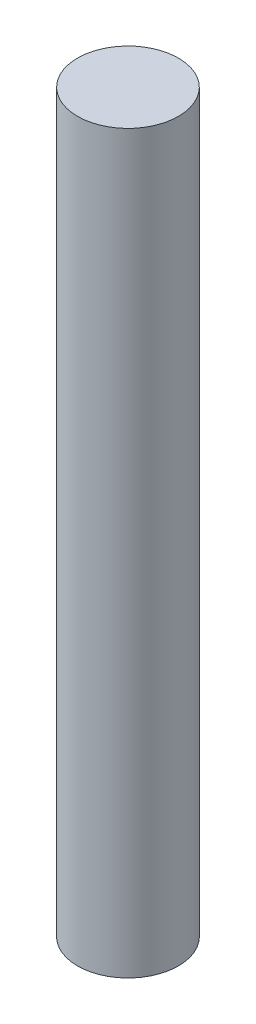
ISO-10303-21;
HEADER;
FILE_DESCRIPTION(('STEP AP214'),'2;1');
FILE_NAME('part.step','',(''),(''),'','','');
FILE_SCHEMA(('AUTOMOTIVE_DESIGN { 1 0 10303 214 1 1 1 1 }'));
ENDSEC;
DATA;
#1=APPLICATION_CONTEXT('core data for automotive mechanical design processes');
#2=APPLICATION_PROTOCOL_DEFINITION('international standard','automotive_design',2000,#1);
#3=PRODUCT_CONTEXT('',#1,'mechanical');
#4=PRODUCT('Part','Part','',(#3));
#5=PRODUCT_RELATED_PRODUCT_CATEGORY('part','',(#4));
#6=PRODUCT_DEFINITION_FORMATION('','',#4);
#7=PRODUCT_DEFINITION_CONTEXT('part definition',#1,'design');
#8=PRODUCT_DEFINITION('design','',#6,#7);
#9=PRODUCT_DEFINITION_SHAPE('','',#8);
#10=(LENGTH_UNIT() NAMED_UNIT(*) SI_UNIT(.MILLI.,.METRE.));
#11=(NAMED_UNIT(*) PLANE_ANGLE_UNIT() SI_UNIT($,.RADIAN.));
#12=(NAMED_UNIT(*) SI_UNIT($,.STERADIAN.) SOLID_ANGLE_UNIT());
#13=UNCERTAINTY_MEASURE_WITH_UNIT(LENGTH_MEASURE(1.E-05),#10,'distance_accuracy_value','');
#14=(GEOMETRIC_REPRESENTATION_CONTEXT(3) GLOBAL_UNCERTAINTY_ASSIGNED_CONTEXT((#13)) GLOBAL_UNIT_ASSIGNED_CONTEXT((#10,
#11,#12)) REPRESENTATION_CONTEXT('',''));
#15=CARTESIAN_POINT('',(0.,0.,0.));
#16=DIRECTION('',(0.,0.,1.));
#17=DIRECTION('',(1.,0.,0.));
#18=AXIS2_PLACEMENT_3D('',#15,#16,#17);
#19=CARTESIAN_POINT('',(-5.11932013646299,72.9,-3.65665724033072));
#20=DIRECTION('',(0.,-1.,0.));
#21=DIRECTION('',(0.,0.,-1.));
#22=AXIS2_PLACEMENT_3D('',#19,#20,#21);
#23=CYLINDRICAL_SURFACE('',#22,5.);
#24=CARTESIAN_POINT('',(-5.11932013646299,72.9,-3.65665724033072));
#25=DIRECTION('',(0.,1.,0.));
#26=DIRECTION('',(0.,0.,1.));
#27=AXIS2_PLACEMENT_3D('',#24,#25,#26);
#28=CIRCLE('',#27,5.);
#29=CARTESIAN_POINT('',(-5.11932013646299,72.9,1.34334275966928));
#30=VERTEX_POINT('',#29);
#31=EDGE_CURVE('E10',#30,#30,#28,.T.);
#32=ORIENTED_EDGE('',*,*,#31,.F.);
#33=EDGE_LOOP('',(#32));
#34=FACE_BOUND('',#33,.T.);
#35=CARTESIAN_POINT('',(-5.11932013646299,0.,-3.65665724033072));
#36=DIRECTION('',(0.,1.,0.));
#37=DIRECTION('',(0.,0.,1.));
#38=AXIS2_PLACEMENT_3D('',#35,#36,#37);
#39=CIRCLE('',#38,5.);
#40=CARTESIAN_POINT('',(-5.11932013646299,0.,1.34334275966928));
#41=VERTEX_POINT('',#40);
#42=EDGE_CURVE('E35',#41,#41,#39,.T.);
#43=ORIENTED_EDGE('',*,*,#42,.T.);
#44=EDGE_LOOP('',(#43));
#45=FACE_BOUND('',#44,.T.);
#46=ADVANCED_FACE('F32',(#34,#45),#23,.T.);
#47=CARTESIAN_POINT('',(-5.11932013646299,72.9,-3.65665724033072));
#48=DIRECTION('',(0.,1.,0.));
#49=DIRECTION('',(0.,0.,1.));
#50=AXIS2_PLACEMENT_3D('',#47,#48,#49);
#51=PLANE('',#50);
#52=ORIENTED_EDGE('',*,*,#31,.T.);
#53=EDGE_LOOP('',(#52));
#54=FACE_BOUND('',#53,.T.);
#55=ADVANCED_FACE('F47',(#54),#51,.T.);
#56=CARTESIAN_POINT('',(-5.11932013646299,0.,-3.65665724033072));
#57=DIRECTION('',(0.,1.,0.));
#58=DIRECTION('',(0.,0.,1.));
#59=AXIS2_PLACEMENT_3D('',#56,#57,#58);
#60=PLANE('',#59);
#61=ORIENTED_EDGE('',*,*,#42,.F.);
#62=EDGE_LOOP('',(#61));
#63=FACE_BOUND('',#62,.T.);
#64=ADVANCED_FACE('F45',(#63),#60,.F.);
#65=CLOSED_SHELL('',(#46,#55,#64));
#66=MANIFOLD_SOLID_BREP('B2',#65);
#67=ADVANCED_BREP_SHAPE_REPRESENTATION('',(#18,#66),#14);
#68=SHAPE_DEFINITION_REPRESENTATION(#9,#67);
ENDSEC;
END-ISO-10303-21;
